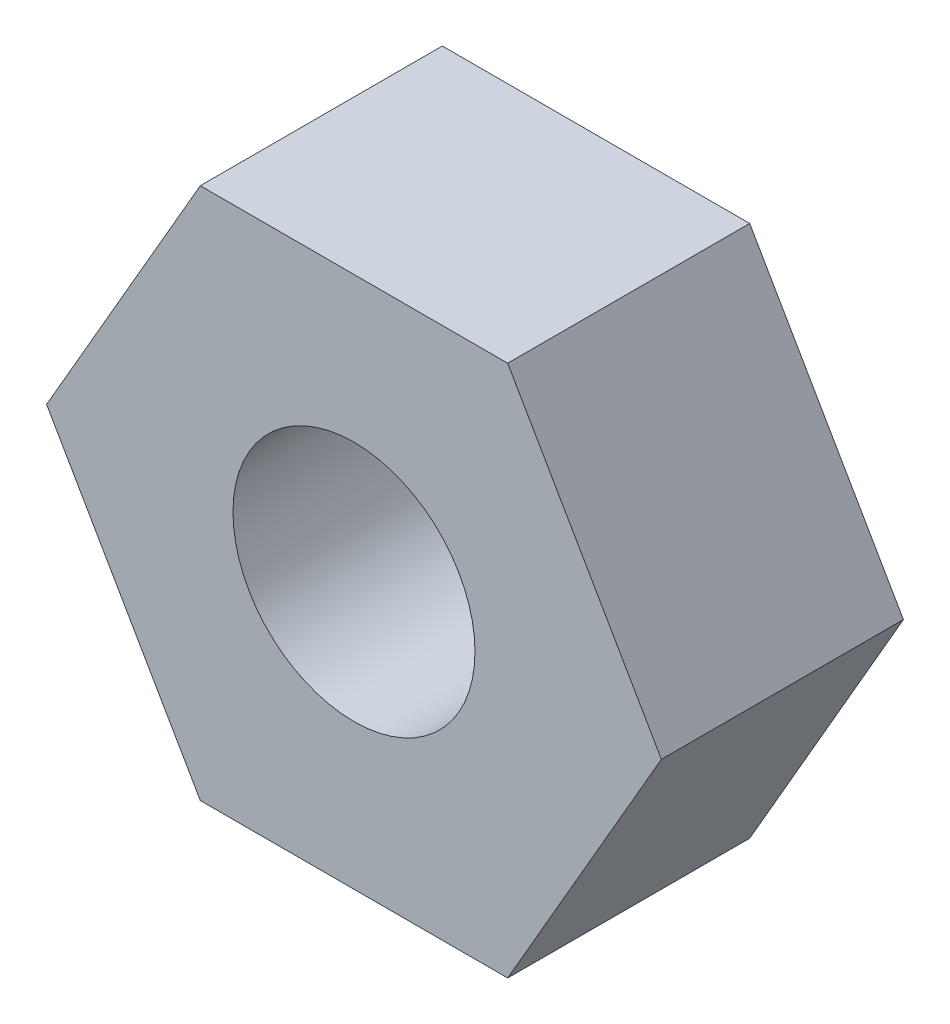
ISO-10303-21;
HEADER;
FILE_DESCRIPTION(('STEP AP214'),'2;1');
FILE_NAME('part.step','',(''),(''),'','','');
FILE_SCHEMA(('AUTOMOTIVE_DESIGN { 1 0 10303 214 1 1 1 1 }'));
ENDSEC;
DATA;
#1=APPLICATION_CONTEXT('core data for automotive mechanical design processes');
#2=APPLICATION_PROTOCOL_DEFINITION('international standard','automotive_design',2000,#1);
#3=PRODUCT_CONTEXT('',#1,'mechanical');
#4=PRODUCT('Part','Part','',(#3));
#5=PRODUCT_RELATED_PRODUCT_CATEGORY('part','',(#4));
#6=PRODUCT_DEFINITION_FORMATION('','',#4);
#7=PRODUCT_DEFINITION_CONTEXT('part definition',#1,'design');
#8=PRODUCT_DEFINITION('design','',#6,#7);
#9=PRODUCT_DEFINITION_SHAPE('','',#8);
#10=(LENGTH_UNIT() NAMED_UNIT(*) SI_UNIT(.MILLI.,.METRE.));
#11=(NAMED_UNIT(*) PLANE_ANGLE_UNIT() SI_UNIT($,.RADIAN.));
#12=(NAMED_UNIT(*) SI_UNIT($,.STERADIAN.) SOLID_ANGLE_UNIT());
#13=UNCERTAINTY_MEASURE_WITH_UNIT(LENGTH_MEASURE(1.E-05),#10,'distance_accuracy_value','');
#14=(GEOMETRIC_REPRESENTATION_CONTEXT(3) GLOBAL_UNCERTAINTY_ASSIGNED_CONTEXT((#13)) GLOBAL_UNIT_ASSIGNED_CONTEXT((#10,
#11,#12)) REPRESENTATION_CONTEXT('',''));
#15=CARTESIAN_POINT('',(0.,0.,0.));
#16=DIRECTION('',(0.,0.,1.));
#17=DIRECTION('',(1.,0.,0.));
#18=AXIS2_PLACEMENT_3D('',#15,#16,#17);
#19=CARTESIAN_POINT('',(0.,0.,2.5));
#20=DIRECTION('',(0.,0.,-1.));
#21=DIRECTION('',(-1.,0.,0.));
#22=AXIS2_PLACEMENT_3D('',#19,#20,#21);
#23=PLANE('',#22);
#24=DIRECTION('',(-0.5,-0.866025403784439,0.));
#25=VECTOR('',#24,1.);
#26=CARTESIAN_POINT('',(-3.17542648054294,0.,2.5));
#27=LINE('',#26,#25);
#28=CARTESIAN_POINT('',(-1.58771324027147,2.75,2.5));
#29=VERTEX_POINT('',#28);
#30=CARTESIAN_POINT('',(-3.17542648054294,0.,2.5));
#31=VERTEX_POINT('',#30);
#32=EDGE_CURVE('E129',#29,#31,#27,.T.);
#33=ORIENTED_EDGE('',*,*,#32,.T.);
#34=DIRECTION('',(0.5,-0.866025403784439,0.));
#35=VECTOR('',#34,1.);
#36=CARTESIAN_POINT('',(-1.58771324027147,-2.75,2.5));
#37=LINE('',#36,#35);
#38=CARTESIAN_POINT('',(-1.58771324027147,-2.75,2.5));
#39=VERTEX_POINT('',#38);
#40=EDGE_CURVE('E87',#31,#39,#37,.T.);
#41=ORIENTED_EDGE('',*,*,#40,.T.);
#42=DIRECTION('',(1.,0.,0.));
#43=VECTOR('',#42,1.);
#44=CARTESIAN_POINT('',(1.58771324027147,-2.75,2.5));
#45=LINE('',#44,#43);
#46=CARTESIAN_POINT('',(1.58771324027147,-2.75,2.5));
#47=VERTEX_POINT('',#46);
#48=EDGE_CURVE('E100',#39,#47,#45,.T.);
#49=ORIENTED_EDGE('',*,*,#48,.T.);
#50=DIRECTION('',(0.5,0.866025403784439,0.));
#51=VECTOR('',#50,1.);
#52=CARTESIAN_POINT('',(3.17542648054294,0.,2.5));
#53=LINE('',#52,#51);
#54=CARTESIAN_POINT('',(3.17542648054294,0.,2.5));
#55=VERTEX_POINT('',#54);
#56=EDGE_CURVE('E94',#47,#55,#53,.T.);
#57=ORIENTED_EDGE('',*,*,#56,.T.);
#58=DIRECTION('',(-0.5,0.866025403784439,0.));
#59=VECTOR('',#58,1.);
#60=CARTESIAN_POINT('',(1.58771324027147,2.75,2.5));
#61=LINE('',#60,#59);
#62=CARTESIAN_POINT('',(1.58771324027147,2.75,2.5));
#63=VERTEX_POINT('',#62);
#64=EDGE_CURVE('E98',#55,#63,#61,.T.);
#65=ORIENTED_EDGE('',*,*,#64,.T.);
#66=DIRECTION('',(-1.,0.,0.));
#67=VECTOR('',#66,1.);
#68=CARTESIAN_POINT('',(-1.58771324027147,2.75,2.5));
#69=LINE('',#68,#67);
#70=EDGE_CURVE('E50',#63,#29,#69,.T.);
#71=ORIENTED_EDGE('',*,*,#70,.T.);
#72=EDGE_LOOP('',(#33,#41,#49,#57,#65,#71));
#73=FACE_BOUND('',#72,.T.);
#74=CARTESIAN_POINT('',(0.,0.,2.5));
#75=DIRECTION('',(0.,0.,1.));
#76=DIRECTION('',(1.,0.,0.));
#77=AXIS2_PLACEMENT_3D('',#74,#75,#76);
#78=CIRCLE('',#77,1.25);
#79=CARTESIAN_POINT('',(1.25,0.,2.5));
#80=VERTEX_POINT('',#79);
#81=EDGE_CURVE('E122',#80,#80,#78,.T.);
#82=ORIENTED_EDGE('',*,*,#81,.F.);
#83=EDGE_LOOP('',(#82));
#84=FACE_BOUND('',#83,.T.);
#85=ADVANCED_FACE('F33',(#73,#84),#23,.F.);
#86=CARTESIAN_POINT('',(0.,0.,0.));
#87=DIRECTION('',(0.,0.,-1.));
#88=DIRECTION('',(-1.,0.,0.));
#89=AXIS2_PLACEMENT_3D('',#86,#87,#88);
#90=PLANE('',#89);
#91=DIRECTION('',(-0.5,-0.866025403784439,0.));
#92=VECTOR('',#91,1.);
#93=CARTESIAN_POINT('',(-3.17542648054294,0.,0.));
#94=LINE('',#93,#92);
#95=CARTESIAN_POINT('',(-1.58771324027147,2.75,0.));
#96=VERTEX_POINT('',#95);
#97=CARTESIAN_POINT('',(-3.17542648054294,0.,0.));
#98=VERTEX_POINT('',#97);
#99=EDGE_CURVE('E118',#96,#98,#94,.T.);
#100=ORIENTED_EDGE('',*,*,#99,.F.);
#101=DIRECTION('',(-1.,0.,0.));
#102=VECTOR('',#101,1.);
#103=CARTESIAN_POINT('',(-1.58771324027147,2.75,0.));
#104=LINE('',#103,#102);
#105=CARTESIAN_POINT('',(1.58771324027147,2.75,0.));
#106=VERTEX_POINT('',#105);
#107=EDGE_CURVE('E79',#106,#96,#104,.T.);
#108=ORIENTED_EDGE('',*,*,#107,.F.);
#109=DIRECTION('',(-0.5,0.866025403784439,0.));
#110=VECTOR('',#109,1.);
#111=CARTESIAN_POINT('',(1.58771324027147,2.75,0.));
#112=LINE('',#111,#110);
#113=CARTESIAN_POINT('',(3.17542648054294,0.,0.));
#114=VERTEX_POINT('',#113);
#115=EDGE_CURVE('E73',#114,#106,#112,.T.);
#116=ORIENTED_EDGE('',*,*,#115,.F.);
#117=DIRECTION('',(0.5,0.866025403784439,0.));
#118=VECTOR('',#117,1.);
#119=CARTESIAN_POINT('',(3.17542648054294,0.,0.));
#120=LINE('',#119,#118);
#121=CARTESIAN_POINT('',(1.58771324027147,-2.75,0.));
#122=VERTEX_POINT('',#121);
#123=EDGE_CURVE('E108',#122,#114,#120,.T.);
#124=ORIENTED_EDGE('',*,*,#123,.F.);
#125=DIRECTION('',(1.,0.,0.));
#126=VECTOR('',#125,1.);
#127=CARTESIAN_POINT('',(1.58771324027147,-2.75,0.));
#128=LINE('',#127,#126);
#129=CARTESIAN_POINT('',(-1.58771324027147,-2.75,0.));
#130=VERTEX_POINT('',#129);
#131=EDGE_CURVE('E124',#130,#122,#128,.T.);
#132=ORIENTED_EDGE('',*,*,#131,.F.);
#133=DIRECTION('',(0.5,-0.866025403784439,0.));
#134=VECTOR('',#133,1.);
#135=CARTESIAN_POINT('',(-1.58771324027147,-2.75,0.));
#136=LINE('',#135,#134);
#137=EDGE_CURVE('E121',#98,#130,#136,.T.);
#138=ORIENTED_EDGE('',*,*,#137,.F.);
#139=EDGE_LOOP('',(#100,#108,#116,#124,#132,#138));
#140=FACE_BOUND('',#139,.T.);
#141=CARTESIAN_POINT('',(0.,0.,0.));
#142=DIRECTION('',(0.,0.,1.));
#143=DIRECTION('',(1.,0.,0.));
#144=AXIS2_PLACEMENT_3D('',#141,#142,#143);
#145=CIRCLE('',#144,1.25);
#146=CARTESIAN_POINT('',(1.25,0.,0.));
#147=VERTEX_POINT('',#146);
#148=EDGE_CURVE('E222',#147,#147,#145,.T.);
#149=ORIENTED_EDGE('',*,*,#148,.T.);
#150=EDGE_LOOP('',(#149));
#151=FACE_BOUND('',#150,.T.);
#152=ADVANCED_FACE('F138',(#140,#151),#90,.T.);
#153=CARTESIAN_POINT('',(-3.17542648054294,0.,2.5));
#154=DIRECTION('',(0.866025403784439,-0.5,0.));
#155=DIRECTION('',(0.5,0.866025403784439,0.));
#156=AXIS2_PLACEMENT_3D('',#153,#154,#155);
#157=PLANE('',#156);
#158=ORIENTED_EDGE('',*,*,#99,.T.);
#159=DIRECTION('',(0.,0.,-1.));
#160=VECTOR('',#159,1.);
#161=CARTESIAN_POINT('',(-3.17542648054294,0.,2.5));
#162=LINE('',#161,#160);
#163=EDGE_CURVE('E11',#31,#98,#162,.T.);
#164=ORIENTED_EDGE('',*,*,#163,.F.);
#165=ORIENTED_EDGE('',*,*,#32,.F.);
#166=DIRECTION('',(0.,0.,-1.));
#167=VECTOR('',#166,1.);
#168=CARTESIAN_POINT('',(-1.58771324027147,2.75,2.5));
#169=LINE('',#168,#167);
#170=EDGE_CURVE('E114',#29,#96,#169,.T.);
#171=ORIENTED_EDGE('',*,*,#170,.T.);
#172=EDGE_LOOP('',(#158,#164,#165,#171));
#173=FACE_BOUND('',#172,.T.);
#174=ADVANCED_FACE('F35',(#173),#157,.F.);
#175=CARTESIAN_POINT('',(-1.58771324027147,-2.75,2.5));
#176=DIRECTION('',(0.866025403784439,0.5,0.));
#177=DIRECTION('',(-0.5,0.866025403784439,0.));
#178=AXIS2_PLACEMENT_3D('',#175,#176,#177);
#179=PLANE('',#178);
#180=ORIENTED_EDGE('',*,*,#137,.T.);
#181=DIRECTION('',(0.,0.,-1.));
#182=VECTOR('',#181,1.);
#183=CARTESIAN_POINT('',(-1.58771324027147,-2.75,2.5));
#184=LINE('',#183,#182);
#185=EDGE_CURVE('E42',#39,#130,#184,.T.);
#186=ORIENTED_EDGE('',*,*,#185,.F.);
#187=ORIENTED_EDGE('',*,*,#40,.F.);
#188=ORIENTED_EDGE('',*,*,#163,.T.);
#189=EDGE_LOOP('',(#180,#186,#187,#188));
#190=FACE_BOUND('',#189,.T.);
#191=ADVANCED_FACE('F163',(#190),#179,.F.);
#192=CARTESIAN_POINT('',(1.58771324027147,-2.75,2.5));
#193=DIRECTION('',(0.,1.,0.));
#194=DIRECTION('',(-1.,0.,0.));
#195=AXIS2_PLACEMENT_3D('',#192,#193,#194);
#196=PLANE('',#195);
#197=ORIENTED_EDGE('',*,*,#131,.T.);
#198=DIRECTION('',(0.,0.,-1.));
#199=VECTOR('',#198,1.);
#200=CARTESIAN_POINT('',(1.58771324027147,-2.75,2.5));
#201=LINE('',#200,#199);
#202=EDGE_CURVE('E109',#47,#122,#201,.T.);
#203=ORIENTED_EDGE('',*,*,#202,.F.);
#204=ORIENTED_EDGE('',*,*,#48,.F.);
#205=ORIENTED_EDGE('',*,*,#185,.T.);
#206=EDGE_LOOP('',(#197,#203,#204,#205));
#207=FACE_BOUND('',#206,.T.);
#208=ADVANCED_FACE('F135',(#207),#196,.F.);
#209=CARTESIAN_POINT('',(3.17542648054294,0.,2.5));
#210=DIRECTION('',(-0.866025403784439,0.5,0.));
#211=DIRECTION('',(-0.5,-0.866025403784439,0.));
#212=AXIS2_PLACEMENT_3D('',#209,#210,#211);
#213=PLANE('',#212);
#214=ORIENTED_EDGE('',*,*,#123,.T.);
#215=DIRECTION('',(0.,0.,-1.));
#216=VECTOR('',#215,1.);
#217=CARTESIAN_POINT('',(3.17542648054294,0.,2.5));
#218=LINE('',#217,#216);
#219=EDGE_CURVE('E105',#55,#114,#218,.T.);
#220=ORIENTED_EDGE('',*,*,#219,.F.);
#221=ORIENTED_EDGE('',*,*,#56,.F.);
#222=ORIENTED_EDGE('',*,*,#202,.T.);
#223=EDGE_LOOP('',(#214,#220,#221,#222));
#224=FACE_BOUND('',#223,.T.);
#225=ADVANCED_FACE('F106',(#224),#213,.F.);
#226=CARTESIAN_POINT('',(1.58771324027147,2.75,2.5));
#227=DIRECTION('',(-0.866025403784439,-0.5,0.));
#228=DIRECTION('',(0.5,-0.866025403784439,0.));
#229=AXIS2_PLACEMENT_3D('',#226,#227,#228);
#230=PLANE('',#229);
#231=ORIENTED_EDGE('',*,*,#115,.T.);
#232=DIRECTION('',(0.,0.,-1.));
#233=VECTOR('',#232,1.);
#234=CARTESIAN_POINT('',(1.58771324027147,2.75,2.5));
#235=LINE('',#234,#233);
#236=EDGE_CURVE('E110',#63,#106,#235,.T.);
#237=ORIENTED_EDGE('',*,*,#236,.F.);
#238=ORIENTED_EDGE('',*,*,#64,.F.);
#239=ORIENTED_EDGE('',*,*,#219,.T.);
#240=EDGE_LOOP('',(#231,#237,#238,#239));
#241=FACE_BOUND('',#240,.T.);
#242=ADVANCED_FACE('F112',(#241),#230,.F.);
#243=CARTESIAN_POINT('',(-1.58771324027147,2.75,2.5));
#244=DIRECTION('',(0.,-1.,0.));
#245=DIRECTION('',(0.,0.,-1.));
#246=AXIS2_PLACEMENT_3D('',#243,#244,#245);
#247=PLANE('',#246);
#248=ORIENTED_EDGE('',*,*,#107,.T.);
#249=ORIENTED_EDGE('',*,*,#170,.F.);
#250=ORIENTED_EDGE('',*,*,#70,.F.);
#251=ORIENTED_EDGE('',*,*,#236,.T.);
#252=EDGE_LOOP('',(#248,#249,#250,#251));
#253=FACE_BOUND('',#252,.T.);
#254=ADVANCED_FACE('F143',(#253),#247,.F.);
#255=CARTESIAN_POINT('',(0.,0.,2.5));
#256=DIRECTION('',(0.,0.,-1.));
#257=DIRECTION('',(-1.,0.,0.));
#258=AXIS2_PLACEMENT_3D('',#255,#256,#257);
#259=CYLINDRICAL_SURFACE('',#258,1.25);
#260=ORIENTED_EDGE('',*,*,#81,.T.);
#261=EDGE_LOOP('',(#260));
#262=FACE_BOUND('',#261,.T.);
#263=ORIENTED_EDGE('',*,*,#148,.F.);
#264=EDGE_LOOP('',(#263));
#265=FACE_BOUND('',#264,.T.);
#266=ADVANCED_FACE('F145',(#262,#265),#259,.F.);
#267=CLOSED_SHELL('',(#85,#152,#174,#191,#208,#225,#242,#254,#266));
#268=MANIFOLD_SOLID_BREP('B2',#267);
#269=ADVANCED_BREP_SHAPE_REPRESENTATION('',(#18,#268),#14);
#270=SHAPE_DEFINITION_REPRESENTATION(#9,#269);
ENDSEC;
END-ISO-10303-21;
